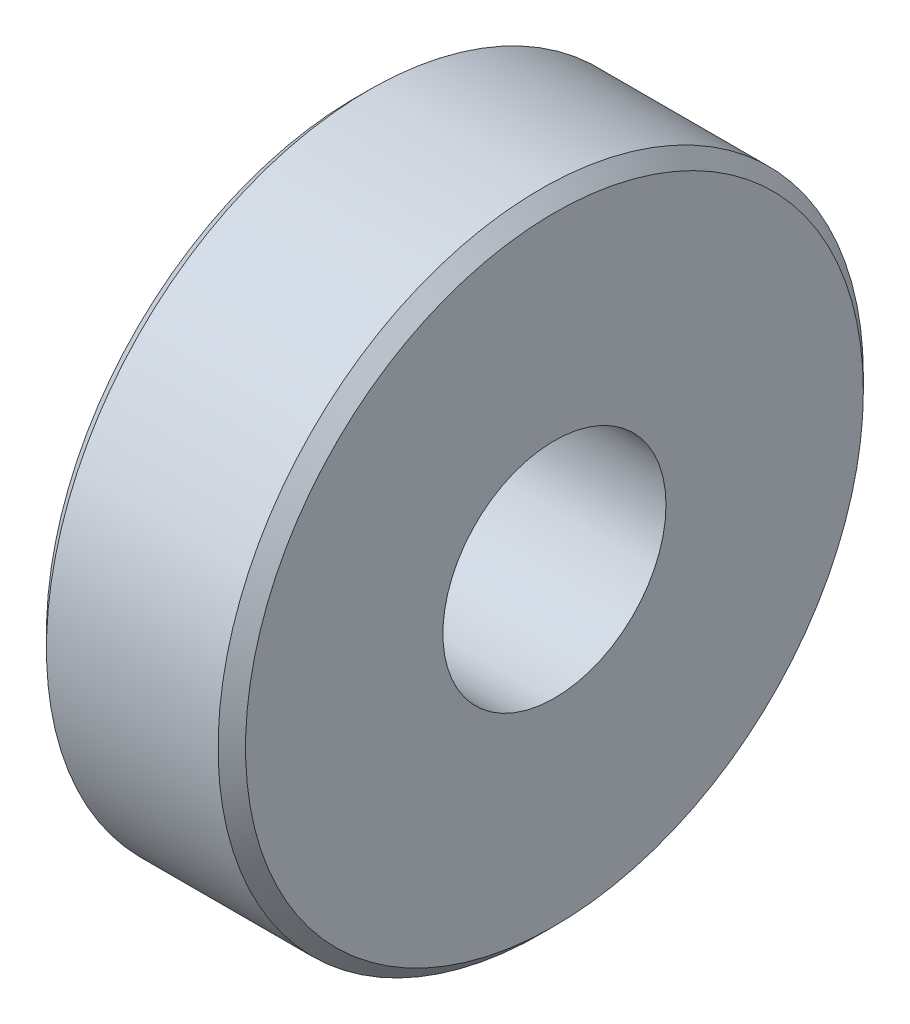
ISO-10303-21;
HEADER;
FILE_DESCRIPTION(('STEP AP214'),'2;1');
FILE_NAME('part.step','',(''),(''),'','','');
FILE_SCHEMA(('AUTOMOTIVE_DESIGN { 1 0 10303 214 1 1 1 1 }'));
ENDSEC;
DATA;
#1=APPLICATION_CONTEXT('core data for automotive mechanical design processes');
#2=APPLICATION_PROTOCOL_DEFINITION('international standard','automotive_design',2000,#1);
#3=PRODUCT_CONTEXT('',#1,'mechanical');
#4=PRODUCT('Part','Part','',(#3));
#5=PRODUCT_RELATED_PRODUCT_CATEGORY('part','',(#4));
#6=PRODUCT_DEFINITION_FORMATION('','',#4);
#7=PRODUCT_DEFINITION_CONTEXT('part definition',#1,'design');
#8=PRODUCT_DEFINITION('design','',#6,#7);
#9=PRODUCT_DEFINITION_SHAPE('','',#8);
#10=(LENGTH_UNIT() NAMED_UNIT(*) SI_UNIT(.MILLI.,.METRE.));
#11=(NAMED_UNIT(*) PLANE_ANGLE_UNIT() SI_UNIT($,.RADIAN.));
#12=(NAMED_UNIT(*) SI_UNIT($,.STERADIAN.) SOLID_ANGLE_UNIT());
#13=UNCERTAINTY_MEASURE_WITH_UNIT(LENGTH_MEASURE(1.E-05),#10,'distance_accuracy_value','');
#14=(GEOMETRIC_REPRESENTATION_CONTEXT(3) GLOBAL_UNCERTAINTY_ASSIGNED_CONTEXT((#13)) GLOBAL_UNIT_ASSIGNED_CONTEXT((#10,
#11,#12)) REPRESENTATION_CONTEXT('',''));
#15=CARTESIAN_POINT('',(0.,0.,0.));
#16=DIRECTION('',(0.,0.,1.));
#17=DIRECTION('',(1.,0.,0.));
#18=AXIS2_PLACEMENT_3D('',#15,#16,#17);
#19=CARTESIAN_POINT('',(1.45,0.,0.));
#20=DIRECTION('',(-1.,0.,0.));
#21=DIRECTION('',(0.,0.,1.));
#22=AXIS2_PLACEMENT_3D('',#19,#20,#21);
#23=CONICAL_SURFACE('',#22,4.49999999999999,0.785398163397453);
#24=CARTESIAN_POINT('',(1.24999999999999,0.,0.));
#25=DIRECTION('',(1.,0.,0.));
#26=DIRECTION('',(0.,0.,-1.));
#27=AXIS2_PLACEMENT_3D('',#24,#25,#26);
#28=CIRCLE('',#27,4.7);
#29=CARTESIAN_POINT('',(1.24999999999999,0.,-4.7));
#30=VERTEX_POINT('',#29);
#31=EDGE_CURVE('E52',#30,#30,#28,.T.);
#32=ORIENTED_EDGE('',*,*,#31,.T.);
#33=EDGE_LOOP('',(#32));
#34=FACE_BOUND('',#33,.T.);
#35=CARTESIAN_POINT('',(1.45,0.,0.));
#36=DIRECTION('',(1.,0.,0.));
#37=DIRECTION('',(0.,0.,-1.));
#38=AXIS2_PLACEMENT_3D('',#35,#36,#37);
#39=CIRCLE('',#38,4.49999999999999);
#40=CARTESIAN_POINT('',(1.45,0.,-4.49999999999999));
#41=VERTEX_POINT('',#40);
#42=EDGE_CURVE('E10',#41,#41,#39,.T.);
#43=ORIENTED_EDGE('',*,*,#42,.F.);
#44=EDGE_LOOP('',(#43));
#45=FACE_BOUND('',#44,.T.);
#46=ADVANCED_FACE('F30',(#34,#45),#23,.T.);
#47=CARTESIAN_POINT('',(1.45,1.625,0.));
#48=DIRECTION('',(1.,0.,0.));
#49=DIRECTION('',(0.,0.,-1.));
#50=AXIS2_PLACEMENT_3D('',#47,#48,#49);
#51=PLANE('',#50);
#52=ORIENTED_EDGE('',*,*,#42,.T.);
#53=EDGE_LOOP('',(#52));
#54=FACE_BOUND('',#53,.T.);
#55=CARTESIAN_POINT('',(1.45,0.,0.));
#56=DIRECTION('',(1.,0.,0.));
#57=DIRECTION('',(0.,0.,-1.));
#58=AXIS2_PLACEMENT_3D('',#55,#56,#57);
#59=CIRCLE('',#58,1.625);
#60=CARTESIAN_POINT('',(1.45,0.,-1.625));
#61=VERTEX_POINT('',#60);
#62=EDGE_CURVE('E36',#61,#61,#59,.T.);
#63=ORIENTED_EDGE('',*,*,#62,.F.);
#64=EDGE_LOOP('',(#63));
#65=FACE_BOUND('',#64,.T.);
#66=ADVANCED_FACE('F70',(#54,#65),#51,.T.);
#67=CARTESIAN_POINT('',(4.13730763288449,0.,0.));
#68=DIRECTION('',(1.,0.,0.));
#69=DIRECTION('',(0.,0.,-1.));
#70=AXIS2_PLACEMENT_3D('',#67,#68,#69);
#71=CYLINDRICAL_SURFACE('',#70,1.625);
#72=ORIENTED_EDGE('',*,*,#62,.T.);
#73=EDGE_LOOP('',(#72));
#74=FACE_BOUND('',#73,.T.);
#75=CARTESIAN_POINT('',(-1.45,0.,0.));
#76=DIRECTION('',(1.,0.,0.));
#77=DIRECTION('',(0.,0.,-1.));
#78=AXIS2_PLACEMENT_3D('',#75,#76,#77);
#79=CIRCLE('',#78,1.625);
#80=CARTESIAN_POINT('',(-1.45,0.,-1.625));
#81=VERTEX_POINT('',#80);
#82=EDGE_CURVE('E40',#81,#81,#79,.T.);
#83=ORIENTED_EDGE('',*,*,#82,.F.);
#84=EDGE_LOOP('',(#83));
#85=FACE_BOUND('',#84,.T.);
#86=ADVANCED_FACE('F74',(#74,#85),#71,.F.);
#87=CARTESIAN_POINT('',(-1.45,4.49999999999999,0.));
#88=DIRECTION('',(-1.,0.,0.));
#89=DIRECTION('',(0.,0.,1.));
#90=AXIS2_PLACEMENT_3D('',#87,#88,#89);
#91=PLANE('',#90);
#92=ORIENTED_EDGE('',*,*,#82,.T.);
#93=EDGE_LOOP('',(#92));
#94=FACE_BOUND('',#93,.T.);
#95=CARTESIAN_POINT('',(-1.45,0.,0.));
#96=DIRECTION('',(1.,0.,0.));
#97=DIRECTION('',(0.,0.,-1.));
#98=AXIS2_PLACEMENT_3D('',#95,#96,#97);
#99=CIRCLE('',#98,4.49999999999999);
#100=CARTESIAN_POINT('',(-1.45,0.,-4.49999999999999));
#101=VERTEX_POINT('',#100);
#102=EDGE_CURVE('E44',#101,#101,#99,.T.);
#103=ORIENTED_EDGE('',*,*,#102,.F.);
#104=EDGE_LOOP('',(#103));
#105=FACE_BOUND('',#104,.T.);
#106=ADVANCED_FACE('F66',(#94,#105),#91,.T.);
#107=CARTESIAN_POINT('',(-1.24999999999999,0.,0.));
#108=DIRECTION('',(1.,0.,0.));
#109=DIRECTION('',(0.,0.,-1.));
#110=AXIS2_PLACEMENT_3D('',#107,#108,#109);
#111=CONICAL_SURFACE('',#110,4.7,0.785398163397453);
#112=ORIENTED_EDGE('',*,*,#102,.T.);
#113=EDGE_LOOP('',(#112));
#114=FACE_BOUND('',#113,.T.);
#115=CARTESIAN_POINT('',(-1.24999999999999,0.,0.));
#116=DIRECTION('',(1.,0.,0.));
#117=DIRECTION('',(0.,0.,-1.));
#118=AXIS2_PLACEMENT_3D('',#115,#116,#117);
#119=CIRCLE('',#118,4.7);
#120=CARTESIAN_POINT('',(-1.24999999999999,0.,-4.7));
#121=VERTEX_POINT('',#120);
#122=EDGE_CURVE('E49',#121,#121,#119,.T.);
#123=ORIENTED_EDGE('',*,*,#122,.F.);
#124=EDGE_LOOP('',(#123));
#125=FACE_BOUND('',#124,.T.);
#126=ADVANCED_FACE('F60',(#114,#125),#111,.T.);
#127=CARTESIAN_POINT('',(4.13730763288449,0.,0.));
#128=DIRECTION('',(1.,0.,0.));
#129=DIRECTION('',(0.,0.,-1.));
#130=AXIS2_PLACEMENT_3D('',#127,#128,#129);
#131=CYLINDRICAL_SURFACE('',#130,4.7);
#132=ORIENTED_EDGE('',*,*,#122,.T.);
#133=EDGE_LOOP('',(#132));
#134=FACE_BOUND('',#133,.T.);
#135=ORIENTED_EDGE('',*,*,#31,.F.);
#136=EDGE_LOOP('',(#135));
#137=FACE_BOUND('',#136,.T.);
#138=ADVANCED_FACE('F58',(#134,#137),#131,.T.);
#139=CLOSED_SHELL('',(#46,#66,#86,#106,#126,#138));
#140=MANIFOLD_SOLID_BREP('B2',#139);
#141=ADVANCED_BREP_SHAPE_REPRESENTATION('',(#18,#140),#14);
#142=SHAPE_DEFINITION_REPRESENTATION(#9,#141);
ENDSEC;
END-ISO-10303-21;
